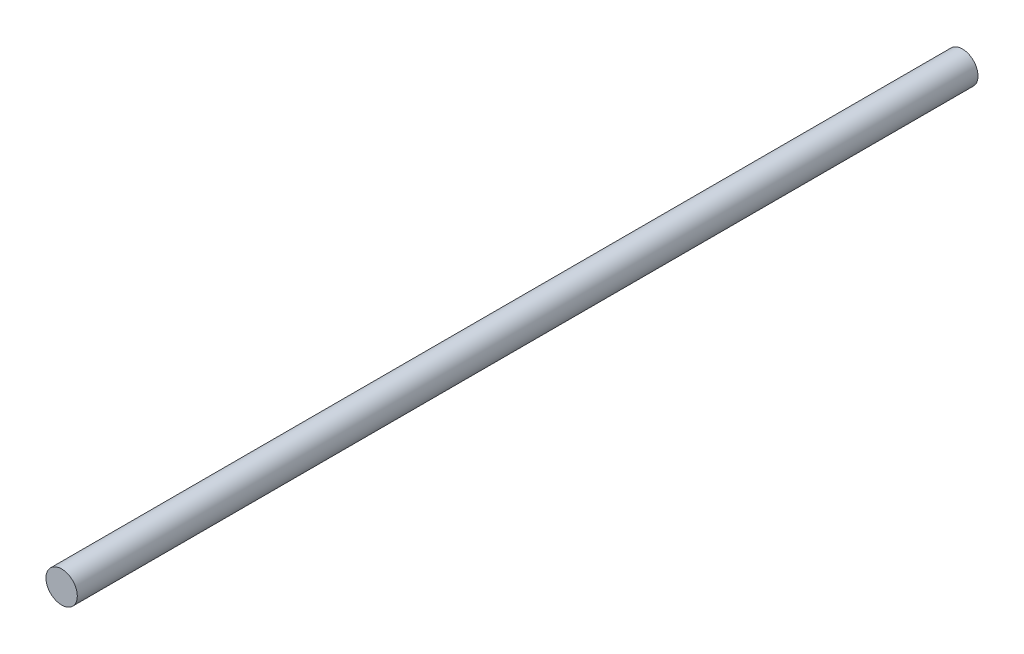
ISO-10303-21;
HEADER;
FILE_DESCRIPTION(('STEP AP214'),'2;1');
FILE_NAME('part.step','',(''),(''),'','','');
FILE_SCHEMA(('AUTOMOTIVE_DESIGN { 1 0 10303 214 1 1 1 1 }'));
ENDSEC;
DATA;
#1=APPLICATION_CONTEXT('core data for automotive mechanical design processes');
#2=APPLICATION_PROTOCOL_DEFINITION('international standard','automotive_design',2000,#1);
#3=PRODUCT_CONTEXT('',#1,'mechanical');
#4=PRODUCT('Part','Part','',(#3));
#5=PRODUCT_RELATED_PRODUCT_CATEGORY('part','',(#4));
#6=PRODUCT_DEFINITION_FORMATION('','',#4);
#7=PRODUCT_DEFINITION_CONTEXT('part definition',#1,'design');
#8=PRODUCT_DEFINITION('design','',#6,#7);
#9=PRODUCT_DEFINITION_SHAPE('','',#8);
#10=(LENGTH_UNIT() NAMED_UNIT(*) SI_UNIT(.MILLI.,.METRE.));
#11=(NAMED_UNIT(*) PLANE_ANGLE_UNIT() SI_UNIT($,.RADIAN.));
#12=(NAMED_UNIT(*) SI_UNIT($,.STERADIAN.) SOLID_ANGLE_UNIT());
#13=UNCERTAINTY_MEASURE_WITH_UNIT(LENGTH_MEASURE(1.E-05),#10,'distance_accuracy_value','');
#14=(GEOMETRIC_REPRESENTATION_CONTEXT(3) GLOBAL_UNCERTAINTY_ASSIGNED_CONTEXT((#13)) GLOBAL_UNIT_ASSIGNED_CONTEXT((#10,
#11,#12)) REPRESENTATION_CONTEXT('',''));
#15=CARTESIAN_POINT('',(0.,0.,0.));
#16=DIRECTION('',(0.,0.,1.));
#17=DIRECTION('',(1.,0.,0.));
#18=AXIS2_PLACEMENT_3D('',#15,#16,#17);
#19=CARTESIAN_POINT('',(-32.4003719135817,2.11877907861435,230.));
#20=DIRECTION('',(0.,0.,-1.));
#21=DIRECTION('',(-1.,0.,0.));
#22=AXIS2_PLACEMENT_3D('',#19,#20,#21);
#23=CYLINDRICAL_SURFACE('',#22,4.);
#24=CARTESIAN_POINT('',(-32.4003719135817,2.11877907861435,230.));
#25=DIRECTION('',(0.,0.,1.));
#26=DIRECTION('',(1.,0.,0.));
#27=AXIS2_PLACEMENT_3D('',#24,#25,#26);
#28=CIRCLE('',#27,4.);
#29=CARTESIAN_POINT('',(-28.4003719135817,2.11877907861435,230.));
#30=VERTEX_POINT('',#29);
#31=EDGE_CURVE('E10',#30,#30,#28,.T.);
#32=ORIENTED_EDGE('',*,*,#31,.F.);
#33=EDGE_LOOP('',(#32));
#34=FACE_BOUND('',#33,.T.);
#35=CARTESIAN_POINT('',(-32.4003719135817,2.11877907861435,0.));
#36=DIRECTION('',(0.,0.,1.));
#37=DIRECTION('',(1.,0.,0.));
#38=AXIS2_PLACEMENT_3D('',#35,#36,#37);
#39=CIRCLE('',#38,4.);
#40=CARTESIAN_POINT('',(-28.4003719135817,2.11877907861435,0.));
#41=VERTEX_POINT('',#40);
#42=EDGE_CURVE('E34',#41,#41,#39,.T.);
#43=ORIENTED_EDGE('',*,*,#42,.T.);
#44=EDGE_LOOP('',(#43));
#45=FACE_BOUND('',#44,.T.);
#46=ADVANCED_FACE('F31',(#34,#45),#23,.T.);
#47=CARTESIAN_POINT('',(-32.4003719135817,2.11877907861435,230.));
#48=DIRECTION('',(0.,0.,1.));
#49=DIRECTION('',(1.,0.,0.));
#50=AXIS2_PLACEMENT_3D('',#47,#48,#49);
#51=PLANE('',#50);
#52=ORIENTED_EDGE('',*,*,#31,.T.);
#53=EDGE_LOOP('',(#52));
#54=FACE_BOUND('',#53,.T.);
#55=ADVANCED_FACE('F46',(#54),#51,.T.);
#56=CARTESIAN_POINT('',(-32.4003719135817,2.11877907861435,0.));
#57=DIRECTION('',(0.,0.,1.));
#58=DIRECTION('',(1.,0.,0.));
#59=AXIS2_PLACEMENT_3D('',#56,#57,#58);
#60=PLANE('',#59);
#61=ORIENTED_EDGE('',*,*,#42,.F.);
#62=EDGE_LOOP('',(#61));
#63=FACE_BOUND('',#62,.T.);
#64=ADVANCED_FACE('F44',(#63),#60,.F.);
#65=CLOSED_SHELL('',(#46,#55,#64));
#66=MANIFOLD_SOLID_BREP('B2',#65);
#67=ADVANCED_BREP_SHAPE_REPRESENTATION('',(#18,#66),#14);
#68=SHAPE_DEFINITION_REPRESENTATION(#9,#67);
ENDSEC;
END-ISO-10303-21;
